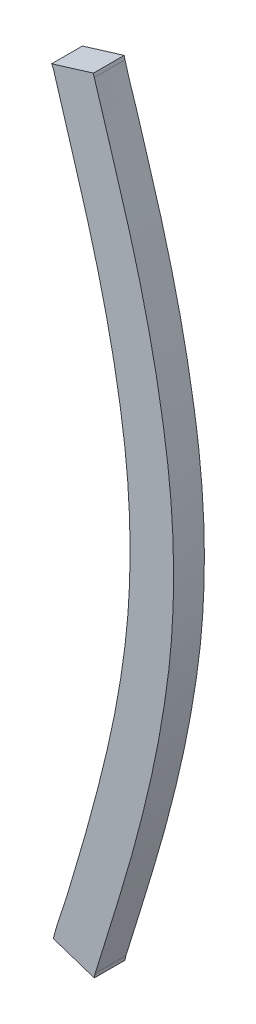
ISO-10303-21;
HEADER;
FILE_DESCRIPTION(('STEP AP214'),'2;1');
FILE_NAME('part.step','',(''),(''),'','','');
FILE_SCHEMA(('AUTOMOTIVE_DESIGN { 1 0 10303 214 1 1 1 1 }'));
ENDSEC;
DATA;
#1=APPLICATION_CONTEXT('core data for automotive mechanical design processes');
#2=APPLICATION_PROTOCOL_DEFINITION('international standard','automotive_design',2000,#1);
#3=PRODUCT_CONTEXT('',#1,'mechanical');
#4=PRODUCT('Part','Part','',(#3));
#5=PRODUCT_RELATED_PRODUCT_CATEGORY('part','',(#4));
#6=PRODUCT_DEFINITION_FORMATION('','',#4);
#7=PRODUCT_DEFINITION_CONTEXT('part definition',#1,'design');
#8=PRODUCT_DEFINITION('design','',#6,#7);
#9=PRODUCT_DEFINITION_SHAPE('','',#8);
#10=(LENGTH_UNIT() NAMED_UNIT(*) SI_UNIT(.MILLI.,.METRE.));
#11=(NAMED_UNIT(*) PLANE_ANGLE_UNIT() SI_UNIT($,.RADIAN.));
#12=(NAMED_UNIT(*) SI_UNIT($,.STERADIAN.) SOLID_ANGLE_UNIT());
#13=UNCERTAINTY_MEASURE_WITH_UNIT(LENGTH_MEASURE(1.E-05),#10,'distance_accuracy_value','');
#14=(GEOMETRIC_REPRESENTATION_CONTEXT(3) GLOBAL_UNCERTAINTY_ASSIGNED_CONTEXT((#13)) GLOBAL_UNIT_ASSIGNED_CONTEXT((#10,
#11,#12)) REPRESENTATION_CONTEXT('',''));
#15=CARTESIAN_POINT('',(0.,0.,0.));
#16=DIRECTION('',(0.,0.,1.));
#17=DIRECTION('',(1.,0.,0.));
#18=AXIS2_PLACEMENT_3D('',#15,#16,#17);
#19=CARTESIAN_POINT('',(66.3073401627196,66.6349835347944,-39.1));
#20=DIRECTION('',(0.,0.,1.));
#21=DIRECTION('',(1.,0.,0.));
#22=AXIS2_PLACEMENT_3D('',#19,#20,#21);
#23=PLANE('',#22);
#24=DIRECTION('',(-0.956199955505762,-0.292714272099566,0.));
#25=VECTOR('',#24,1.);
#26=CARTESIAN_POINT('',(66.1881037685923,67.906777776933,-39.1));
#27=LINE('',#26,#25);
#28=CARTESIAN_POINT('',(66.1881037685923,67.906777776933,-39.1));
#29=VERTEX_POINT('',#28);
#30=CARTESIAN_POINT('',(66.0521814384861,67.8651689003696,-39.1));
#31=VERTEX_POINT('',#30);
#32=EDGE_CURVE('E101',#29,#31,#27,.T.);
#33=ORIENTED_EDGE('',*,*,#32,.F.);
#34=DIRECTION('',(-0.242535624627491,0.970142500247542,0.));
#35=VECTOR('',#34,1.);
#36=CARTESIAN_POINT('',(66.1908776936903,67.8956820765211,-39.1));
#37=LINE('',#36,#35);
#38=CARTESIAN_POINT('',(66.1908776936915,67.8956820765214,-39.1));
#39=VERTEX_POINT('',#38);
#40=EDGE_CURVE('E121',#39,#29,#37,.T.);
#41=ORIENTED_EDGE('',*,*,#40,.F.);
#42=CARTESIAN_POINT('',(66.1908776936903,67.8956820765211,-39.1));
#43=CARTESIAN_POINT('',(66.1949100956217,67.879485195284,-39.1));
#44=CARTESIAN_POINT('',(66.1996702183467,67.8635135187491,-39.1));
#45=CARTESIAN_POINT('',(66.2097512732118,67.8317435159787,-39.1));
#46=CARTESIAN_POINT('',(66.2150721679429,67.8159451782574,-39.1));
#47=CARTESIAN_POINT('',(66.2253957707861,67.7841970095985,-39.1));
#48=CARTESIAN_POINT('',(66.2303975173439,67.7682468732174,-39.1));
#49=CARTESIAN_POINT('',(66.24017664113,67.7362771955672,-39.1));
#50=CARTESIAN_POINT('',(66.244954003785,67.7202576498636,-39.1));
#51=CARTESIAN_POINT('',(66.2546019658417,67.6881978226611,-39.1));
#52=CARTESIAN_POINT('',(66.2594727891244,67.6721576089782,-39.1));
#53=CARTESIAN_POINT('',(66.2692643704026,67.6400923919098,-39.1));
#54=CARTESIAN_POINT('',(66.2741851288675,67.6240673886688,-39.1));
#55=CARTESIAN_POINT('',(66.2888098463517,67.5759514918485,-39.1));
#56=CARTESIAN_POINT('',(66.2983767842087,67.5438180150709,-39.1));
#57=CARTESIAN_POINT('',(66.3167492425625,67.4793348292764,-39.1));
#58=CARTESIAN_POINT('',(66.3255548067466,67.446985132781,-39.1));
#59=CARTESIAN_POINT('',(66.3424424435593,67.3820962463252,-39.1));
#60=CARTESIAN_POINT('',(66.3505244740774,67.3495570454527,-39.1));
#61=CARTESIAN_POINT('',(66.3659243126035,67.2844568086756,-39.1));
#62=CARTESIAN_POINT('',(66.3732454935245,67.2518965750754,-39.1));
#63=CARTESIAN_POINT('',(66.3870148319496,67.1865903993272,-39.1));
#64=CARTESIAN_POINT('',(66.3934629659575,67.1538444522058,-39.1));
#65=CARTESIAN_POINT('',(66.4055119735171,67.0881885336106,-39.1));
#66=CARTESIAN_POINT('',(66.4111126137631,67.0552785195371,-39.1));
#67=CARTESIAN_POINT('',(66.4214432172407,66.9893226424474,-39.1));
#68=CARTESIAN_POINT('',(66.4261732481647,66.9562767901973,-39.1));
#69=CARTESIAN_POINT('',(66.4344361644341,66.889560300961,-39.1));
#70=CARTESIAN_POINT('',(66.4379513346324,66.8558874003231,-39.1));
#71=CARTESIAN_POINT('',(66.4434830487162,66.7884169869836,-39.1));
#72=CARTESIAN_POINT('',(66.4454994910045,66.7546194659902,-39.1));
#73=CARTESIAN_POINT('',(66.4481929946213,66.6869947243158,-39.1));
#74=CARTESIAN_POINT('',(66.448870940258,66.6531675380254,-39.1));
#75=CARTESIAN_POINT('',(66.4488341845366,66.5855149809781,-39.1));
#76=CARTESIAN_POINT('',(66.4481195653743,66.5516896102319,-39.1));
#77=CARTESIAN_POINT('',(66.4452352666491,66.4838735305297,-39.1));
#78=CARTESIAN_POINT('',(66.4430559391487,66.449883218584,-39.1));
#79=CARTESIAN_POINT('',(66.4371004000183,66.3820422554482,-39.1));
#80=CARTESIAN_POINT('',(66.4333241462651,66.3481916079659,-39.1));
#81=CARTESIAN_POINT('',(66.4244455699415,66.280653461139,-39.1));
#82=CARTESIAN_POINT('',(66.4193425831648,66.2469660521464,-39.1));
#83=CARTESIAN_POINT('',(66.4082332710518,66.1797410443805,-39.1));
#84=CARTESIAN_POINT('',(66.4022269244004,66.1462034491613,-39.1));
#85=CARTESIAN_POINT('',(66.3916574033664,66.0917353257149,-39.1));
#86=CARTESIAN_POINT('',(66.3873865759565,66.0707479796797,-39.1));
#87=CARTESIAN_POINT('',(66.3784691157759,66.0288548487377,-39.1));
#88=CARTESIAN_POINT('',(66.3738225072378,66.0079490586627,-39.1));
#89=CARTESIAN_POINT('',(66.3642111024512,65.96621830755,-39.1));
#90=CARTESIAN_POINT('',(66.3592464112983,65.9453933222014,-39.1));
#91=CARTESIAN_POINT('',(66.349044358843,65.9038097340505,-39.1));
#92=CARTESIAN_POINT('',(66.3438069885578,65.883051133459,-39.1));
#93=CARTESIAN_POINT('',(66.3330873996252,65.8415938876343,-39.1));
#94=CARTESIAN_POINT('',(66.3276051452555,65.8208952516205,-39.1));
#95=CARTESIAN_POINT('',(66.3163442664211,65.7795793046133,-39.1));
#96=CARTESIAN_POINT('',(66.31056565071,65.7589619912372,-39.1));
#97=CARTESIAN_POINT('',(66.2930007616699,65.6977009432553,-39.1));
#98=CARTESIAN_POINT('',(66.2808579810464,65.6571601672551,-39.1));
#99=CARTESIAN_POINT('',(66.2624215985308,65.5964211329038,-39.1));
#100=CARTESIAN_POINT('',(66.25623944103,65.5761878964162,-39.1));
#101=CARTESIAN_POINT('',(66.2438478011464,65.5357299214944,-39.1));
#102=CARTESIAN_POINT('',(66.237638319145,65.5155051829458,-39.1));
#103=CARTESIAN_POINT('',(66.2251718914417,65.4750856272525,-39.1));
#104=CARTESIAN_POINT('',(66.2189149814144,65.4548907990922,-39.1));
#105=CARTESIAN_POINT('',(66.2063357490695,65.414521237999,-39.1));
#106=CARTESIAN_POINT('',(66.2000134258803,65.394346505338,-39.1));
#107=CARTESIAN_POINT('',(66.1936516187903,65.3741841569611,-39.1));
#108=B_SPLINE_CURVE_WITH_KNOTS('',3,(#42,#43,#44,#45,#46,#47,#48,#49,#50,#51,#52,#53,#54,#55,
#56,#57,#58,#59,#60,#61,#62,#63,#64,#65,#66,#67,#68,#69,#70,#71,#72,#73,#74,#75,#76,#77,#78,#79,
#80,#81,#82,#83,#84,#85,#86,#87,#88,#89,#90,#91,#92,#93,#94,#95,#96,#97,#98,#99,#100,#101,#102,
#103,#104,#105,#106,#107),.UNSPECIFIED.,.F.,.F.,(4,2,2,2,2,2,2,2,2,2,2,2,2,2,2,2,2,2,2,2,2,2,2,
2,2,2,2,2,2,2,2,2,4),(0.,0.050005533873164,0.100007733990341,0.150154089960554,
0.200303698352787,0.250593931280111,0.300884637337104,0.401460712453303,0.502031012749006,
0.602607162584607,0.702716504353397,0.802828539807175,0.902968085035616,1.00309984082596,
1.1046355514676,1.20617814448562,1.30765362860986,1.40912312334895,1.51126762805103,
1.61341482726061,1.71561326353314,1.81781411160631,1.8820630523216,1.94630785315916,
2.01053153562376,2.07475733509857,2.13899253428385,2.20322583723369,2.33018001954719,
2.39365028116976,2.45711965961665,2.52054528003948,2.58397174672142),.UNSPECIFIED.);
#109=CARTESIAN_POINT('',(66.1936516187903,65.3741841569611,-39.1));
#110=VERTEX_POINT('',#109);
#111=EDGE_CURVE('E188',#39,#110,#108,.T.);
#112=ORIENTED_EDGE('',*,*,#111,.T.);
#113=DIRECTION('',(-0.196116135135519,-0.980580675691453,0.));
#114=VECTOR('',#113,1.);
#115=CARTESIAN_POINT('',(66.1908776936865,65.3603145314419,-39.1));
#116=LINE('',#115,#114);
#117=CARTESIAN_POINT('',(66.1908776936866,65.3603145314423,-39.1));
#118=VERTEX_POINT('',#117);
#119=EDGE_CURVE('E125',#110,#118,#116,.T.);
#120=ORIENTED_EDGE('',*,*,#119,.T.);
#121=DIRECTION('',(-0.948683298050562,0.316227766016693,0.));
#122=VECTOR('',#121,1.);
#123=CARTESIAN_POINT('',(66.0577292886893,65.4046973331081,-39.1));
#124=LINE('',#123,#122);
#125=CARTESIAN_POINT('',(66.0577292886896,65.4046973331091,-39.1));
#126=VERTEX_POINT('',#125);
#127=EDGE_CURVE('E132',#118,#126,#124,.T.);
#128=ORIENTED_EDGE('',*,*,#127,.T.);
#129=DIRECTION('',(0.242535625038474,0.970142500144797,0.));
#130=VECTOR('',#129,1.);
#131=CARTESIAN_POINT('',(66.0605032137927,65.4157930335206,-39.1));
#132=LINE('',#131,#130);
#133=CARTESIAN_POINT('',(66.0605032137915,65.4157930335208,-39.1));
#134=VERTEX_POINT('',#133);
#135=EDGE_CURVE('E104',#126,#134,#132,.T.);
#136=ORIENTED_EDGE('',*,*,#135,.T.);
#137=CARTESIAN_POINT('',(66.0605032137903,65.4157930335211,-39.1));
#138=CARTESIAN_POINT('',(66.0645436760544,65.431991659247,-39.1));
#139=CARTESIAN_POINT('',(66.0694367751525,65.4479186572461,-39.1));
#140=CARTESIAN_POINT('',(66.0798208785655,65.4795843167803,-39.1));
#141=CARTESIAN_POINT('',(66.0853118849576,65.4953229776608,-39.1));
#142=CARTESIAN_POINT('',(66.0958031573863,65.5270234788328,-39.1));
#143=CARTESIAN_POINT('',(66.1008015941166,65.542985916827,-39.1));
#144=CARTESIAN_POINT('',(66.1105078497719,65.5749970870055,-39.1));
#145=CARTESIAN_POINT('',(66.1152156689648,65.5910458191102,-39.1));
#146=CARTESIAN_POINT('',(66.1294512207146,65.6392539812142,-39.1));
#147=CARTESIAN_POINT('',(66.1390658524147,65.6713877429036,-39.1));
#148=CARTESIAN_POINT('',(66.1578111251696,65.7357939340475,-39.1));
#149=CARTESIAN_POINT('',(66.166941816939,65.7680663485871,-39.1));
#150=CARTESIAN_POINT('',(66.1846694851496,65.8327615228004,-39.1));
#151=CARTESIAN_POINT('',(66.1932663898901,65.865184302046,-39.1));
#152=CARTESIAN_POINT('',(66.2100327991604,65.9301537387485,-39.1));
#153=CARTESIAN_POINT('',(66.2182021336407,65.9627004400527,-39.1));
#154=CARTESIAN_POINT('',(66.2338174308743,66.0277860622279,-39.1));
#155=CARTESIAN_POINT('',(66.2412670359188,66.0603240898983,-39.1));
#156=CARTESIAN_POINT('',(66.2550831613337,66.1256334854618,-39.1));
#157=CARTESIAN_POINT('',(66.2614495916585,66.1584048725187,-39.1));
#158=CARTESIAN_POINT('',(66.2731884317776,66.2241004199131,-39.1));
#159=CARTESIAN_POINT('',(66.2785615498504,66.2570244541002,-39.1));
#160=CARTESIAN_POINT('',(66.2881078088414,66.3230448940766,-39.1));
#161=CARTESIAN_POINT('',(66.2922811512317,66.3561412699739,-39.1));
#162=CARTESIAN_POINT('',(66.2991584679311,66.4229712234038,-39.1));
#163=CARTESIAN_POINT('',(66.3018403787454,66.4567071059616,-39.1));
#164=CARTESIAN_POINT('',(66.3056611295301,66.5242711142321,-39.1));
#165=CARTESIAN_POINT('',(66.3067996744955,66.5580992563417,-39.1));
#166=CARTESIAN_POINT('',(66.3076173534394,66.6257808704905,-39.1));
#167=CARTESIAN_POINT('',(66.3072960907074,66.6596343469152,-39.1));
#168=CARTESIAN_POINT('',(66.3052637466596,66.7272945844777,-39.1));
#169=CARTESIAN_POINT('',(66.3035528984555,66.7611013524984,-39.1));
#170=CARTESIAN_POINT('',(66.2985822901862,66.8288648138037,-39.1));
#171=CARTESIAN_POINT('',(66.2953106882462,66.862820653042,-39.1));
#172=CARTESIAN_POINT('',(66.287332990706,66.930561862238,-39.1));
#173=CARTESIAN_POINT('',(66.2826266753372,66.9643472052725,-39.1));
#174=CARTESIAN_POINT('',(66.2670161695563,67.0654664361305,-39.1));
#175=CARTESIAN_POINT('',(66.2546192533633,67.1325758688591,-39.1));
#176=CARTESIAN_POINT('',(66.2343301742017,67.2271624953206,-39.1));
#177=CARTESIAN_POINT('',(66.2280116422179,67.2549885582841,-39.1));
#178=CARTESIAN_POINT('',(66.2148371136719,67.3105129732235,-39.1));
#179=CARTESIAN_POINT('',(66.2079811242059,67.3382113268804,-39.1));
#180=CARTESIAN_POINT('',(66.1937787023789,67.3934827757198,-39.1));
#181=CARTESIAN_POINT('',(66.186432261494,67.4210558687165,-39.1));
#182=CARTESIAN_POINT('',(66.1711713276532,67.4760443448068,-39.1));
#183=CARTESIAN_POINT('',(66.1632568269273,67.5034597257378,-39.1));
#184=CARTESIAN_POINT('',(66.147235416187,67.5578243956035,-39.1));
#185=CARTESIAN_POINT('',(66.1391326331913,67.5847749205434,-39.1));
#186=CARTESIAN_POINT('',(66.1228816786696,67.6386622693352,-39.1));
#187=CARTESIAN_POINT('',(66.1147335071075,67.6655990931764,-39.1));
#188=CARTESIAN_POINT('',(66.0984680670764,67.7194666338239,-39.1));
#189=CARTESIAN_POINT('',(66.0903507846181,67.7463973464012,-39.1));
#190=CARTESIAN_POINT('',(66.07408147356,67.8002479584269,-39.1));
#191=CARTESIAN_POINT('',(66.0659294453172,67.8271678579833,-39.1));
#192=CARTESIAN_POINT('',(66.0577292886903,67.8540731999611,-39.1));
#193=B_SPLINE_CURVE_WITH_KNOTS('',3,(#137,#138,#139,#140,#141,#142,#143,#144,#145,#146,#147,
#148,#149,#150,#151,#152,#153,#154,#155,#156,#157,#158,#159,#160,#161,#162,#163,#164,#165,#166,
#167,#168,#169,#170,#171,#172,#173,#174,#175,#176,#177,#178,#179,#180,#181,#182,#183,#184,#185,
#186,#187,#188,#189,#190,#191,#192),.UNSPECIFIED.,.F.,.F.,(4,2,2,2,2,2,2,2,2,2,2,2,2,2,2,2,2,2,
2,2,2,2,2,2,2,2,2,4),(0.,0.0499954329236569,0.0999910395343713,0.150165826672778,
0.200340567537613,0.300963593300606,0.401576053292174,0.50220199891074,0.602867665154967,
0.702993807681116,0.803128269754976,0.903191053492104,1.00323702437346,1.10472612494109,
1.20623462180185,1.30777070578083,1.40928975996393,1.51159162368106,1.61390916581287,
1.81850711613617,1.9041061024088,1.9897039586985,2.07530330305843,2.16090381847206,
2.24533044861808,2.32975714595277,2.41413947779715,2.49852094467752),.UNSPECIFIED.);
#194=CARTESIAN_POINT('',(66.0577292886903,67.8540731999611,-39.1));
#195=VERTEX_POINT('',#194);
#196=EDGE_CURVE('E24',#134,#195,#193,.T.);
#197=ORIENTED_EDGE('',*,*,#196,.T.);
#198=DIRECTION('',(-0.447213595498112,0.894427191000839,0.));
#199=VECTOR('',#198,1.);
#200=CARTESIAN_POINT('',(66.0521814384863,67.8651689003691,-39.1));
#201=LINE('',#200,#199);
#202=EDGE_CURVE('E92',#195,#31,#201,.T.);
#203=ORIENTED_EDGE('',*,*,#202,.T.);
#204=EDGE_LOOP('',(#33,#41,#112,#120,#128,#136,#197,#203));
#205=FACE_BOUND('',#204,.T.);
#206=ADVANCED_FACE('F17',(#205),#23,.F.);
#207=CARTESIAN_POINT('',(66.0521814384863,67.8651689003691,-39.));
#208=DIRECTION('',(0.894427191000839,0.447213595498112,0.));
#209=DIRECTION('',(-0.447213595498112,0.894427191000839,0.));
#210=AXIS2_PLACEMENT_3D('',#207,#208,#209);
#211=PLANE('',#210);
#212=DIRECTION('',(0.,0.,1.));
#213=VECTOR('',#212,1.);
#214=CARTESIAN_POINT('',(66.0577292886903,67.8540731999611,-39.05));
#215=LINE('',#214,#213);
#216=CARTESIAN_POINT('',(66.0577292886903,67.8540731999611,-39.));
#217=VERTEX_POINT('',#216);
#218=EDGE_CURVE('E95',#195,#217,#215,.T.);
#219=ORIENTED_EDGE('',*,*,#218,.T.);
#220=DIRECTION('',(0.447213595498616,-0.894427191000587,0.));
#221=VECTOR('',#220,1.);
#222=CARTESIAN_POINT('',(66.0521814384863,67.8651689003691,-39.));
#223=LINE('',#222,#221);
#224=CARTESIAN_POINT('',(66.0521814384862,67.8651689003694,-39.));
#225=VERTEX_POINT('',#224);
#226=EDGE_CURVE('E116',#225,#217,#223,.T.);
#227=ORIENTED_EDGE('',*,*,#226,.F.);
#228=DIRECTION('',(0.,0.,1.));
#229=VECTOR('',#228,1.);
#230=CARTESIAN_POINT('',(66.0521814384861,67.8651689003699,-39.));
#231=LINE('',#230,#229);
#232=EDGE_CURVE('E98',#225,#31,#231,.F.);
#233=ORIENTED_EDGE('',*,*,#232,.T.);
#234=ORIENTED_EDGE('',*,*,#202,.F.);
#235=EDGE_LOOP('',(#219,#227,#233,#234));
#236=FACE_BOUND('',#235,.T.);
#237=ADVANCED_FACE('F93',(#236),#211,.F.);
#238=CARTESIAN_POINT('',(66.0577292886903,67.8540731999611,-39.));
#239=CARTESIAN_POINT('',(66.0577292886903,67.8540731999611,-39.1));
#240=CARTESIAN_POINT('',(66.0682059216903,67.8196707865311,-39.));
#241=CARTESIAN_POINT('',(66.0682059216903,67.8196707865311,-39.1));
#242=CARTESIAN_POINT('',(66.0889660642903,67.7510438935911,-39.));
#243=CARTESIAN_POINT('',(66.0889660642903,67.7510438935911,-39.1));
#244=CARTESIAN_POINT('',(66.1198972626903,67.6483951213011,-39.));
#245=CARTESIAN_POINT('',(66.1198972626903,67.6483951213011,-39.1));
#246=CARTESIAN_POINT('',(66.1507857816903,67.5464464069211,-39.));
#247=CARTESIAN_POINT('',(66.1507857816903,67.5464464069211,-39.1));
#248=CARTESIAN_POINT('',(66.1803116247903,67.4447880284311,-39.));
#249=CARTESIAN_POINT('',(66.1803116247903,67.4447880284311,-39.1));
#250=CARTESIAN_POINT('',(66.2070617543903,67.3430309216311,-39.));
#251=CARTESIAN_POINT('',(66.2070617543903,67.3430309216311,-39.1));
#252=CARTESIAN_POINT('',(66.2315118897903,67.2412876562511,-39.));
#253=CARTESIAN_POINT('',(66.2315118897903,67.2412876562511,-39.1));
#254=CARTESIAN_POINT('',(66.2531842173903,67.1393699167511,-39.));
#255=CARTESIAN_POINT('',(66.2531842173903,67.1393699167511,-39.1));
#256=CARTESIAN_POINT('',(66.2716239185903,67.0371418328911,-39.));
#257=CARTESIAN_POINT('',(66.2716239185903,67.0371418328911,-39.1));
#258=CARTESIAN_POINT('',(66.2872518356903,66.9344695807911,-39.));
#259=CARTESIAN_POINT('',(66.2872518356903,66.9344695807911,-39.1));
#260=CARTESIAN_POINT('',(66.2989974867903,66.8308116247711,-39.));
#261=CARTESIAN_POINT('',(66.2989974867903,66.8308116247711,-39.1));
#262=CARTESIAN_POINT('',(66.3058533485903,66.7257514799511,-39.));
#263=CARTESIAN_POINT('',(66.3058533485903,66.7257514799511,-39.1));
#264=CARTESIAN_POINT('',(66.3081504652903,66.6208066220911,-39.));
#265=CARTESIAN_POINT('',(66.3081504652903,66.6208066220911,-39.1));
#266=CARTESIAN_POINT('',(66.3058569310903,66.5167834233211,-39.));
#267=CARTESIAN_POINT('',(66.3058569310903,66.5167834233211,-39.1));
#268=CARTESIAN_POINT('',(66.2989583077903,66.4144984925611,-39.));
#269=CARTESIAN_POINT('',(66.2989583077903,66.4144984925611,-39.1));
#270=CARTESIAN_POINT('',(66.2872464836903,66.3130391608211,-39.));
#271=CARTESIAN_POINT('',(66.2872464836903,66.3130391608211,-39.1));
#272=CARTESIAN_POINT('',(66.2714906956903,66.2120963559811,-39.));
#273=CARTESIAN_POINT('',(66.2714906956903,66.2120963559811,-39.1));
#274=CARTESIAN_POINT('',(66.2525990837903,66.1112429406511,-39.));
#275=CARTESIAN_POINT('',(66.2525990837903,66.1112429406511,-39.1));
#276=CARTESIAN_POINT('',(66.2300881828903,66.0106192574711,-39.));
#277=CARTESIAN_POINT('',(66.2300881828903,66.0106192574711,-39.1));
#278=CARTESIAN_POINT('',(66.2051511905903,65.9103324506311,-39.));
#279=CARTESIAN_POINT('',(66.2051511905903,65.9103324506311,-39.1));
#280=CARTESIAN_POINT('',(66.1788355862903,65.8104486998011,-39.));
#281=CARTESIAN_POINT('',(66.1788355862903,65.8104486998011,-39.1));
#282=CARTESIAN_POINT('',(66.1509451438903,65.7111680410211,-39.));
#283=CARTESIAN_POINT('',(66.1509451438903,65.7111680410211,-39.1));
#284=CARTESIAN_POINT('',(66.1214054898903,65.6124769099411,-39.));
#285=CARTESIAN_POINT('',(66.1214054898903,65.6124769099411,-39.1));
#286=CARTESIAN_POINT('',(66.0926415411903,65.5136308285811,-39.));
#287=CARTESIAN_POINT('',(66.0926415411903,65.5136308285811,-39.1));
#288=CARTESIAN_POINT('',(66.0688251942903,65.4490809554711,-39.));
#289=CARTESIAN_POINT('',(66.0688251942903,65.4490809554711,-39.1));
#290=CARTESIAN_POINT('',(66.0605032137903,65.4157930335211,-39.));
#291=CARTESIAN_POINT('',(66.0605032137903,65.4157930335211,-39.1));
#292=B_SPLINE_SURFACE_WITH_KNOTS('',3,1,((#238,#239),(#240,#241),(#242,#243),(#244,#245),(#246,
#247),(#248,#249),(#250,#251),(#252,#253),(#254,#255),(#256,#257),(#258,#259),(#260,#261),(#262,
#263),(#264,#265),(#266,#267),(#268,#269),(#270,#271),(#272,#273),(#274,#275),(#276,#277),(#278,
#279),(#280,#281),(#282,#283),(#284,#285),(#286,#287),(#288,#289),(#290,#291)),.UNSPECIFIED.,
.F.,.F.,.F.,(4,1,1,1,1,1,1,1,1,1,1,1,1,1,1,1,1,1,1,1,1,1,1,1,4),(2,2),(0.,0.043180384185,
0.0860889057703,0.1287256158318,0.1710872886221,0.213186632967,0.2550452771582,0.2967197910893,
0.338277659337,0.3797556249214,0.4214002315702,0.4634955092493,0.5061260175783,0.5473999091414,
0.5883874389168,0.6291739907487,0.6699905193445,0.7110360652346,0.7523539460835,0.7937768432598,
0.8351133190984,0.876373889477,0.91759317835728,0.95880065173907,1.),(1.,1.1),.UNSPECIFIED.);
#293=DIRECTION('',(0.,0.,1.));
#294=VECTOR('',#293,1.);
#295=CARTESIAN_POINT('',(66.0605032137927,65.4157930335205,-39.));
#296=LINE('',#295,#294);
#297=CARTESIAN_POINT('',(66.0605032137915,65.4157930335208,-39.));
#298=VERTEX_POINT('',#297);
#299=EDGE_CURVE('E106',#134,#298,#296,.T.);
#300=CARTESIAN_POINT('',(66.0577292886903,67.8540731999611,-39.));
#301=CARTESIAN_POINT('',(66.0625765045228,67.8381568203957,-39.));
#302=CARTESIAN_POINT('',(66.0674098330503,67.8222362224864,-39.));
#303=CARTESIAN_POINT('',(66.0770578450639,67.790390388363,-39.));
#304=CARTESIAN_POINT('',(66.0818725296193,67.7744651524731,-39.));
#305=CARTESIAN_POINT('',(66.0915097617172,67.7425563082784,-39.));
#306=CARTESIAN_POINT('',(66.0963322779056,67.7265726905381,-39.));
#307=CARTESIAN_POINT('',(66.105975280674,67.6946037892601,-39.));
#308=CARTESIAN_POINT('',(66.1107957671178,67.6786185056798,-39.));
#309=CARTESIAN_POINT('',(66.1253282847959,67.6305122578105,-39.));
#310=CARTESIAN_POINT('',(66.1350640691024,67.5983986066873,-39.));
#311=CARTESIAN_POINT('',(66.1542868300022,67.5340963305532,-39.));
#312=CARTESIAN_POINT('',(66.163773815108,67.5019077081486,-39.));
#313=CARTESIAN_POINT('',(66.1820179296096,67.4373241178828,-39.));
#314=CARTESIAN_POINT('',(66.1907750908158,67.4049291590814,-39.));
#315=CARTESIAN_POINT('',(66.2075870821379,67.3399568279704,-39.));
#316=CARTESIAN_POINT('',(66.2156418823061,67.3073794479456,-39.));
#317=CARTESIAN_POINT('',(66.2309634832392,67.2422259613772,-39.));
#318=CARTESIAN_POINT('',(66.2382343473944,67.209650819591,-39.));
#319=CARTESIAN_POINT('',(66.2518175929954,67.1443019854111,-39.));
#320=CARTESIAN_POINT('',(66.2581300141567,67.1115283013032,-39.));
#321=CARTESIAN_POINT('',(66.2698602898268,67.0458192693772,-39.));
#322=CARTESIAN_POINT('',(66.2752780753739,67.0128839092981,-39.));
#323=CARTESIAN_POINT('',(66.2850913178377,66.9468498666373,-39.));
#324=CARTESIAN_POINT('',(66.2894865362087,66.9137511477824,-39.));
#325=CARTESIAN_POINT('',(66.2969030720198,66.8469154614683,-39.));
#326=CARTESIAN_POINT('',(66.2999038145204,66.8131761414646,-39.));
#327=CARTESIAN_POINT('',(66.3044024224437,66.745596607334,-39.));
#328=CARTESIAN_POINT('',(66.3058999862107,66.7117563743221,-39.));
#329=CARTESIAN_POINT('',(66.3083014751542,66.6101989961185,-39.));
#330=CARTESIAN_POINT('',(66.3071179812932,66.5424095576034,-39.));
#331=CARTESIAN_POINT('',(66.3006425401016,66.4407854931689,-39.));
#332=CARTESIAN_POINT('',(66.2976799155136,66.4067889076926,-39.));
#333=CARTESIAN_POINT('',(66.2902006665804,66.3389722671435,-39.));
#334=CARTESIAN_POINT('',(66.2856842430529,66.3051521898313,-39.));
#335=CARTESIAN_POINT('',(66.2754634513363,66.2376736372593,-39.));
#336=CARTESIAN_POINT('',(66.2697583056408,66.2040152825921,-39.));
#337=CARTESIAN_POINT('',(66.2604322664806,66.1536710494427,-39.));
#338=CARTESIAN_POINT('',(66.2571954799501,66.136913275576,-39.));
#339=CARTESIAN_POINT('',(66.2504267239271,66.1034574810634,-39.));
#340=CARTESIAN_POINT('',(66.246894757712,66.0867594597562,-39.));
#341=CARTESIAN_POINT('',(66.2371278836179,66.0422430448912,-39.));
#342=CARTESIAN_POINT('',(66.2306682956901,66.0144741303286,-39.));
#343=CARTESIAN_POINT('',(66.217266904339,65.9590540606052,-39.));
#344=CARTESIAN_POINT('',(66.2103250926801,65.9314029074639,-39.));
#345=CARTESIAN_POINT('',(66.1961292788674,65.8761890095506,-39.));
#346=CARTESIAN_POINT('',(66.1888753621807,65.8486262427684,-39.));
#347=CARTESIAN_POINT('',(66.1740017612852,65.793599841515,-39.));
#348=CARTESIAN_POINT('',(66.1663820854572,65.7661362047878,-39.));
#349=CARTESIAN_POINT('',(66.154710692457,65.7252031064748,-39.));
#350=CARTESIAN_POINT('',(66.150806634809,65.7116913842068,-39.));
#351=CARTESIAN_POINT('',(66.1429183228255,65.6846910088886,-39.));
#352=CARTESIAN_POINT('',(66.1389340661802,65.671202356515,-39.));
#353=CARTESIAN_POINT('',(66.1309437058614,65.6442311967391,-39.));
#354=CARTESIAN_POINT('',(66.1269376016802,65.6307486894875,-39.));
#355=CARTESIAN_POINT('',(66.1189723051318,65.6037707192732,-39.));
#356=CARTESIAN_POINT('',(66.1150131100971,65.5902752570948,-39.));
#357=CARTESIAN_POINT('',(66.1069853916346,65.5633188692329,-39.));
#358=CARTESIAN_POINT('',(66.1029168873732,65.5498579379423,-39.));
#359=CARTESIAN_POINT('',(66.096598929694,65.5297330350213,-39.));
#360=CARTESIAN_POINT('',(66.0944570239403,65.5230356594335,-39.));
#361=CARTESIAN_POINT('',(66.0900747169011,65.5096731078983,-39.));
#362=CARTESIAN_POINT('',(66.0878343083195,65.5030079343769,-39.));
#363=CARTESIAN_POINT('',(66.0810725134284,65.4830236805948,-39.));
#364=CARTESIAN_POINT('',(66.076510786799,65.4697165615948,-39.));
#365=CARTESIAN_POINT('',(66.0679337706379,65.4429326386184,-39.));
#366=CARTESIAN_POINT('',(66.0639184652815,65.4294558395685,-39.));
#367=CARTESIAN_POINT('',(66.0605032137903,65.4157930335211,-39.));
#368=B_SPLINE_CURVE_WITH_KNOTS('',3,(#300,#301,#302,#303,#304,#305,#306,#307,#308,#309,#310,
#311,#312,#313,#314,#315,#316,#317,#318,#319,#320,#321,#322,#323,#324,#325,#326,#327,#328,#329,
#330,#331,#332,#333,#334,#335,#336,#337,#338,#339,#340,#341,#342,#343,#344,#345,#346,#347,#348,
#349,#350,#351,#352,#353,#354,#355,#356,#357,#358,#359,#360,#361,#362,#363,#364,#365,#366,#367),
.UNSPECIFIED.,.F.,.F.,(4,2,2,2,2,2,2,2,2,2,2,2,2,2,2,2,2,2,2,2,2,2,2,2,2,2,2,2,2,2,2,2,2,4),(0.,
0.0499143052477696,0.0998257038452558,0.149911588865139,0.20000042508618,0.300672048602656,
0.40134022321576,0.502004007753483,0.602672082323304,0.702790359615609,0.802904487116077,
0.903026328169082,1.00317150241112,1.10475071443923,1.2063503071685,1.4094423379735,
1.51178644290729,1.61411732554797,1.71651535094635,1.76771587309228,1.81891582684958,
1.90443969333295,1.98996502078658,2.07546707515571,2.16096717129612,2.20316019573632,
2.24535443702104,2.28754966304151,2.32974247789627,2.37192794227109,2.3930216680582,
2.41411695890005,2.45630973467194,2.49850128825252),.UNSPECIFIED.);
#369=EDGE_CURVE('E109',#217,#298,#368,.T.);
#370=ORIENTED_EDGE('',*,*,#299,.T.);
#371=ORIENTED_EDGE('',*,*,#369,.F.);
#372=ORIENTED_EDGE('',*,*,#218,.F.);
#373=ORIENTED_EDGE('',*,*,#196,.F.);
#374=EDGE_LOOP('',(#370,#371,#372,#373));
#375=FACE_BOUND('',#374,.T.);
#376=ADVANCED_FACE('F107',(#375),#292,.F.);
#377=CARTESIAN_POINT('',(66.0605032137927,65.4157930335206,-39.));
#378=DIRECTION('',(0.970142500144797,-0.242535625038474,0.));
#379=DIRECTION('',(0.242535625038474,0.970142500144797,0.));
#380=AXIS2_PLACEMENT_3D('',#377,#378,#379);
#381=PLANE('',#380);
#382=DIRECTION('',(0.,0.,1.));
#383=VECTOR('',#382,1.);
#384=CARTESIAN_POINT('',(66.0577292886893,65.4046973331081,-39.));
#385=LINE('',#384,#383);
#386=CARTESIAN_POINT('',(66.05772928869,65.4046973331101,-39.));
#387=VERTEX_POINT('',#386);
#388=EDGE_CURVE('E134',#126,#387,#385,.T.);
#389=ORIENTED_EDGE('',*,*,#388,.T.);
#390=DIRECTION('',(-0.242535624830199,-0.970142500196865,0.));
#391=VECTOR('',#390,1.);
#392=CARTESIAN_POINT('',(66.0605032137903,65.4157930335211,-39.));
#393=LINE('',#392,#391);
#394=EDGE_CURVE('E211',#298,#387,#393,.T.);
#395=ORIENTED_EDGE('',*,*,#394,.F.);
#396=ORIENTED_EDGE('',*,*,#299,.F.);
#397=ORIENTED_EDGE('',*,*,#135,.F.);
#398=EDGE_LOOP('',(#389,#395,#396,#397));
#399=FACE_BOUND('',#398,.T.);
#400=ADVANCED_FACE('F176',(#399),#381,.F.);
#401=CARTESIAN_POINT('',(66.0577292886893,65.4046973331081,-39.));
#402=DIRECTION('',(0.316227766016693,0.948683298050562,0.));
#403=DIRECTION('',(-0.948683298050562,0.316227766016693,0.));
#404=AXIS2_PLACEMENT_3D('',#401,#402,#403);
#405=PLANE('',#404);
#406=DIRECTION('',(0.,0.,1.));
#407=VECTOR('',#406,1.);
#408=CARTESIAN_POINT('',(66.1908776936866,65.3603145314423,-39.));
#409=LINE('',#408,#407);
#410=CARTESIAN_POINT('',(66.1908776936866,65.3603145314423,-39.));
#411=VERTEX_POINT('',#410);
#412=EDGE_CURVE('E129',#118,#411,#409,.T.);
#413=ORIENTED_EDGE('',*,*,#412,.T.);
#414=DIRECTION('',(0.948683298043296,-0.316227766038493,0.));
#415=VECTOR('',#414,1.);
#416=CARTESIAN_POINT('',(66.0577292886903,65.4046973331111,-39.));
#417=LINE('',#416,#415);
#418=EDGE_CURVE('E208',#387,#411,#417,.T.);
#419=ORIENTED_EDGE('',*,*,#418,.F.);
#420=ORIENTED_EDGE('',*,*,#388,.F.);
#421=ORIENTED_EDGE('',*,*,#127,.F.);
#422=EDGE_LOOP('',(#413,#419,#420,#421));
#423=FACE_BOUND('',#422,.T.);
#424=ADVANCED_FACE('F172',(#423),#405,.F.);
#425=CARTESIAN_POINT('',(66.1908776936865,65.3603145314419,-39.));
#426=DIRECTION('',(-0.980580675691453,0.196116135135519,0.));
#427=DIRECTION('',(-0.196116135135519,-0.980580675691453,0.));
#428=AXIS2_PLACEMENT_3D('',#425,#426,#427);
#429=PLANE('',#428);
#430=DIRECTION('',(0.,0.,1.));
#431=VECTOR('',#430,1.);
#432=CARTESIAN_POINT('',(66.1936516187903,65.3741841569611,-39.05));
#433=LINE('',#432,#431);
#434=CARTESIAN_POINT('',(66.1936516187903,65.3741841569611,-39.));
#435=VERTEX_POINT('',#434);
#436=EDGE_CURVE('E128',#110,#435,#433,.T.);
#437=ORIENTED_EDGE('',*,*,#436,.T.);
#438=DIRECTION('',(0.196116135134976,0.980580675691562,0.));
#439=VECTOR('',#438,1.);
#440=CARTESIAN_POINT('',(66.1908776936866,65.3603145314423,-39.));
#441=LINE('',#440,#439);
#442=EDGE_CURVE('E151',#411,#435,#441,.T.);
#443=ORIENTED_EDGE('',*,*,#442,.F.);
#444=ORIENTED_EDGE('',*,*,#412,.F.);
#445=ORIENTED_EDGE('',*,*,#119,.F.);
#446=EDGE_LOOP('',(#437,#443,#444,#445));
#447=FACE_BOUND('',#446,.T.);
#448=ADVANCED_FACE('F169',(#447),#429,.F.);
#449=CARTESIAN_POINT('',(66.1936516187903,65.3741841569611,-39.));
#450=CARTESIAN_POINT('',(66.1936516187903,65.3741841569611,-39.1));
#451=CARTESIAN_POINT('',(66.2041784498903,65.4075432174612,-39.));
#452=CARTESIAN_POINT('',(66.2041784498903,65.4075432174612,-39.1));
#453=CARTESIAN_POINT('',(66.2250603300903,65.4744885922411,-39.));
#454=CARTESIAN_POINT('',(66.2250603300903,65.4744885922411,-39.1));
#455=CARTESIAN_POINT('',(66.2560005596903,65.5752864088011,-39.));
#456=CARTESIAN_POINT('',(66.2560005596903,65.5752864088011,-39.1));
#457=CARTESIAN_POINT('',(66.2868153495903,65.6765543430611,-39.));
#458=CARTESIAN_POINT('',(66.2868153495903,65.6765543430611,-39.1));
#459=CARTESIAN_POINT('',(66.3164177091903,65.7784541541111,-39.));
#460=CARTESIAN_POINT('',(66.3164177091903,65.7784541541111,-39.1));
#461=CARTESIAN_POINT('',(66.3436282727903,65.8811324841211,-39.));
#462=CARTESIAN_POINT('',(66.3436282727903,65.8811324841211,-39.1));
#463=CARTESIAN_POINT('',(66.3688462076903,65.9843498775512,-39.));
#464=CARTESIAN_POINT('',(66.3688462076903,65.9843498775512,-39.1));
#465=CARTESIAN_POINT('',(66.3914524266903,66.0882053069711,-39.));
#466=CARTESIAN_POINT('',(66.3914524266903,66.0882053069711,-39.1));
#467=CARTESIAN_POINT('',(66.4107999248903,66.1927490688611,-39.));
#468=CARTESIAN_POINT('',(66.4107999248903,66.1927490688611,-39.1));
#469=CARTESIAN_POINT('',(66.4273583407903,66.2979286080511,-39.));
#470=CARTESIAN_POINT('',(66.4273583407903,66.2979286080511,-39.1));
#471=CARTESIAN_POINT('',(66.4398895685903,66.4041010798911,-39.));
#472=CARTESIAN_POINT('',(66.4398895685903,66.4041010798911,-39.1));
#473=CARTESIAN_POINT('',(66.4472276760903,66.5114840789011,-39.));
#474=CARTESIAN_POINT('',(66.4472276760903,66.5114840789011,-39.1));
#475=CARTESIAN_POINT('',(66.4496722124903,66.6208579481711,-39.));
#476=CARTESIAN_POINT('',(66.4496722124903,66.6208579481711,-39.1));
#477=CARTESIAN_POINT('',(66.4472189636903,66.7313073394211,-39.));
#478=CARTESIAN_POINT('',(66.4472189636903,66.7313073394211,-39.1));
#479=CARTESIAN_POINT('',(66.4399079052903,66.8419246016811,-39.));
#480=CARTESIAN_POINT('',(66.4399079052903,66.8419246016811,-39.1));
#481=CARTESIAN_POINT('',(66.4273683415903,66.9510759169511,-39.));
#482=CARTESIAN_POINT('',(66.4273683415903,66.9510759169511,-39.1));
#483=CARTESIAN_POINT('',(66.4108022834903,67.0590805242611,-39.));
#484=CARTESIAN_POINT('',(66.4108022834903,67.0590805242611,-39.1));
#485=CARTESIAN_POINT('',(66.3914461729903,67.1663947214511,-39.));
#486=CARTESIAN_POINT('',(66.3914461729903,67.1663947214511,-39.1));
#487=CARTESIAN_POINT('',(66.3688855687903,67.2729954539511,-39.));
#488=CARTESIAN_POINT('',(66.3688855687903,67.2729954539511,-39.1));
#489=CARTESIAN_POINT('',(66.3435622828903,67.3788127222111,-39.));
#490=CARTESIAN_POINT('',(66.3435622828903,67.3788127222111,-39.1));
#491=CARTESIAN_POINT('',(66.3158764171903,67.4838080767411,-39.));
#492=CARTESIAN_POINT('',(66.3158764171903,67.4838080767411,-39.1));
#493=CARTESIAN_POINT('',(66.2855150246903,67.5877391415711,-39.));
#494=CARTESIAN_POINT('',(66.2855150246903,67.5877391415711,-39.1));
#495=CARTESIAN_POINT('',(66.2535508017903,67.6907667646811,-39.));
#496=CARTESIAN_POINT('',(66.2535508017903,67.6907667646811,-39.1));
#497=CARTESIAN_POINT('',(66.2232930412903,67.7937336746311,-39.));
#498=CARTESIAN_POINT('',(66.2232930412903,67.7937336746311,-39.1));
#499=CARTESIAN_POINT('',(66.1995081505903,67.8611602491412,-39.));
#500=CARTESIAN_POINT('',(66.1995081505903,67.8611602491412,-39.1));
#501=CARTESIAN_POINT('',(66.1908776936903,67.8956820765211,-39.));
#502=CARTESIAN_POINT('',(66.1908776936903,67.8956820765211,-39.1));
#503=B_SPLINE_SURFACE_WITH_KNOTS('',3,1,((#449,#450),(#451,#452),(#453,#454),(#455,#456),(#457,
#458),(#459,#460),(#461,#462),(#463,#464),(#465,#466),(#467,#468),(#469,#470),(#471,#472),(#473,
#474),(#475,#476),(#477,#478),(#479,#480),(#481,#482),(#483,#484),(#485,#486),(#487,#488),(#489,
#490),(#491,#492),(#493,#494),(#495,#496),(#497,#498),(#499,#500),(#501,#502)),.UNSPECIFIED.,
.F.,.F.,.F.,(4,1,1,1,1,1,1,1,1,1,1,1,1,1,1,1,1,1,1,1,1,1,1,1,4),(2,2),(0.,0.0406128007278,
0.0814181767491,0.1224169586869,0.163509332411,0.2046086303817,0.2457331919587,0.286863072488,
0.3279915692911,0.3691546452972,0.4104636711512,0.4520719521595,0.4940696003006,0.5374386335414,
0.5802964806231,0.6227312910984,0.6649554789909,0.7071398868014,0.7493195724515,0.7914437752848,
0.8334536600034,0.875373698589,0.91714391897803,0.95868598027702,1.),(1.,1.1),.UNSPECIFIED.);
#504=DIRECTION('',(0.,0.,1.));
#505=VECTOR('',#504,1.);
#506=CARTESIAN_POINT('',(66.190877693695,67.8956820765223,-39.));
#507=LINE('',#506,#505);
#508=CARTESIAN_POINT('',(66.1908776936927,67.8956820765217,-39.));
#509=VERTEX_POINT('',#508);
#510=EDGE_CURVE('E194',#39,#509,#507,.T.);
#511=CARTESIAN_POINT('',(66.1936516187903,65.3741841569611,-39.));
#512=CARTESIAN_POINT('',(66.1986592225177,65.3900527167076,-39.));
#513=CARTESIAN_POINT('',(66.2036416884455,65.4059291830269,-39.));
#514=CARTESIAN_POINT('',(66.213563968693,65.4376949063737,-39.));
#515=CARTESIAN_POINT('',(66.2185037843186,65.453584162993,-39.));
#516=CARTESIAN_POINT('',(66.2283648261509,65.4854255084128,-39.));
#517=CARTESIAN_POINT('',(66.2332859383875,65.5013776324794,-39.));
#518=CARTESIAN_POINT('',(66.2430996163864,65.5332912301158,-39.));
#519=CARTESIAN_POINT('',(66.2479921812063,65.5492527039752,-39.));
#520=CARTESIAN_POINT('',(66.2626912528392,65.5972923901684,-39.));
#521=CARTESIAN_POINT('',(66.2724735631862,65.6293779807131,-39.));
#522=CARTESIAN_POINT('',(66.2917137285172,65.6936463319878,-39.));
#523=CARTESIAN_POINT('',(66.3011715990559,65.7258290879787,-39.));
#524=CARTESIAN_POINT('',(66.3193945634096,65.7903951845413,-39.));
#525=CARTESIAN_POINT('',(66.3281595769394,65.8227785478911,-39.));
#526=CARTESIAN_POINT('',(66.345064012284,65.8877077738927,-39.));
#527=CARTESIAN_POINT('',(66.3532034273322,65.920253638298,-39.));
#528=CARTESIAN_POINT('',(66.3687457572027,65.985354362498,-39.));
#529=CARTESIAN_POINT('',(66.3761520805555,66.0179083992306,-39.));
#530=CARTESIAN_POINT('',(66.3900279716588,66.0832181989617,-39.));
#531=CARTESIAN_POINT('',(66.396497488146,66.1159739728975,-39.));
#532=CARTESIAN_POINT('',(66.408565951498,66.1816404310537,-39.));
#533=CARTESIAN_POINT('',(66.414165006999,66.2145510954145,-39.));
#534=CARTESIAN_POINT('',(66.4243834558958,66.2805239012648,-39.));
#535=CARTESIAN_POINT('',(66.4290029586215,66.3135860254284,-39.));
#536=CARTESIAN_POINT('',(66.4368977389977,66.3803285013205,-39.));
#537=CARTESIAN_POINT('',(66.4401539875427,66.4140111660213,-39.));
#538=CARTESIAN_POINT('',(66.4451122348687,66.4814926923642,-39.));
#539=CARTESIAN_POINT('',(66.4468140957101,66.5152915640516,-39.));
#540=CARTESIAN_POINT('',(66.4487964438708,66.582922670544,-39.));
#541=CARTESIAN_POINT('',(66.4490772100935,66.6167548974989,-39.));
#542=CARTESIAN_POINT('',(66.4482698479375,66.6844007108366,-39.));
#543=CARTESIAN_POINT('',(66.4471817914779,66.7182142981053,-39.));
#544=CARTESIAN_POINT('',(66.443620906136,66.7860125040559,-39.));
#545=CARTESIAN_POINT('',(66.4411382413021,66.8199966191545,-39.));
#546=CARTESIAN_POINT('',(66.434661808062,66.8878205520191,-39.));
#547=CARTESIAN_POINT('',(66.4306679900171,66.9216603650082,-39.));
#548=CARTESIAN_POINT('',(66.4215052768978,66.9891821279017,-39.));
#549=CARTESIAN_POINT('',(66.4163361393521,67.0228640437662,-39.));
#550=CARTESIAN_POINT('',(66.4051679180867,67.0900902077229,-39.));
#551=CARTESIAN_POINT('',(66.3991688166973,67.1236344528685,-39.));
#552=CARTESIAN_POINT('',(66.3865980799872,67.1886455570117,-39.));
#553=CARTESIAN_POINT('',(66.3800781760569,67.2201223871807,-39.));
#554=CARTESIAN_POINT('',(66.3662777184318,67.2829063382795,-39.));
#555=CARTESIAN_POINT('',(66.3589971938867,67.3142134656646,-39.));
#556=CARTESIAN_POINT('',(66.3437939493079,67.3766712476062,-39.));
#557=CARTESIAN_POINT('',(66.335871230016,67.4078219023433,-39.));
#558=CARTESIAN_POINT('',(66.319323796972,67.4699366157698,-39.));
#559=CARTESIAN_POINT('',(66.3106990842596,67.5009006747353,-39.));
#560=CARTESIAN_POINT('',(66.2973446391397,67.5470016337051,-39.));
#561=CARTESIAN_POINT('',(66.2928554886303,67.5622088769951,-39.));
#562=CARTESIAN_POINT('',(66.2837588759355,67.5925881743744,-39.));
#563=CARTESIAN_POINT('',(66.2791514114642,67.6077602277776,-39.));
#564=CARTESIAN_POINT('',(66.2698887804058,67.6380902112796,-39.));
#565=CARTESIAN_POINT('',(66.2652336124119,67.6532481409474,-39.));
#566=CARTESIAN_POINT('',(66.255999366638,67.6835868565064,-39.));
#567=CARTESIAN_POINT('',(66.2514202878829,67.6987676421021,-39.));
#568=CARTESIAN_POINT('',(66.2422965671124,67.7291304414516,-39.));
#569=CARTESIAN_POINT('',(66.2377519067335,67.7443124494309,-39.));
#570=CARTESIAN_POINT('',(66.2284110678007,67.7745989309159,-39.));
#571=CARTESIAN_POINT('',(66.2236148874605,67.78970340387,-39.));
#572=CARTESIAN_POINT('',(66.2137782028401,67.8198359227815,-39.));
#573=CARTESIAN_POINT('',(66.2087376863645,67.8348639648825,-39.));
#574=CARTESIAN_POINT('',(66.1992016485631,67.8650869058616,-39.));
#575=CARTESIAN_POINT('',(66.1947061302064,67.8802818056482,-39.));
#576=CARTESIAN_POINT('',(66.1908776936903,67.8956820765211,-39.));
#577=B_SPLINE_CURVE_WITH_KNOTS('',3,(#511,#512,#513,#514,#515,#516,#517,#518,#519,#520,#521,
#522,#523,#524,#525,#526,#527,#528,#529,#530,#531,#532,#533,#534,#535,#536,#537,#538,#539,#540,
#541,#542,#543,#544,#545,#546,#547,#548,#549,#550,#551,#552,#553,#554,#555,#556,#557,#558,#559,
#560,#561,#562,#563,#564,#565,#566,#567,#568,#569,#570,#571,#572,#573,#574,#575,#576),
.UNSPECIFIED.,.F.,.F.,(4,2,2,2,2,2,2,2,2,2,2,2,2,2,2,2,2,2,2,2,2,2,2,2,2,2,2,2,2,2,2,2,4),(0.,
0.0499197344682341,0.0998379349669661,0.149919722622277,0.200003154195966,0.300634263472103,
0.401260541381567,0.501898462372232,0.602537471733542,0.70268409972644,0.802836205809952,
0.902975802563012,1.00310421665055,1.10458710170717,1.20607899169493,1.30755096216211,
1.40901760143473,1.51120901967947,1.61340379501931,1.71561967256284,1.81783772660814,
1.9142614640443,2.01068150754282,2.10710143968438,2.20352122902163,2.25108874298747,
2.29865717662204,2.34622701704263,2.39379624743299,2.44133800087251,2.48888009200258,
2.53642455851949,2.5839692840434),.UNSPECIFIED.);
#578=EDGE_CURVE('E143',#435,#509,#577,.T.);
#579=ORIENTED_EDGE('',*,*,#510,.T.);
#580=ORIENTED_EDGE('',*,*,#578,.F.);
#581=ORIENTED_EDGE('',*,*,#436,.F.);
#582=ORIENTED_EDGE('',*,*,#111,.F.);
#583=EDGE_LOOP('',(#579,#580,#581,#582));
#584=FACE_BOUND('',#583,.T.);
#585=ADVANCED_FACE('F19',(#584),#503,.F.);
#586=CARTESIAN_POINT('',(66.190877693695,67.8956820765223,-39.));
#587=DIRECTION('',(-0.970142500144556,-0.242535625039438,0.));
#588=DIRECTION('',(0.242535625039438,-0.970142500144556,0.));
#589=AXIS2_PLACEMENT_3D('',#586,#587,#588);
#590=PLANE('',#589);
#591=DIRECTION('',(0.,0.,1.));
#592=VECTOR('',#591,1.);
#593=CARTESIAN_POINT('',(66.1881037685923,67.906777776933,-39.));
#594=LINE('',#593,#592);
#595=CARTESIAN_POINT('',(66.1881037685923,67.906777776933,-39.));
#596=VERTEX_POINT('',#595);
#597=EDGE_CURVE('E44',#29,#596,#594,.T.);
#598=ORIENTED_EDGE('',*,*,#597,.T.);
#599=DIRECTION('',(-0.242535624627491,0.970142500247542,0.));
#600=VECTOR('',#599,1.);
#601=CARTESIAN_POINT('',(66.1908776936903,67.8956820765211,-39.));
#602=LINE('',#601,#600);
#603=EDGE_CURVE('E35',#509,#596,#602,.T.);
#604=ORIENTED_EDGE('',*,*,#603,.F.);
#605=ORIENTED_EDGE('',*,*,#510,.F.);
#606=ORIENTED_EDGE('',*,*,#40,.T.);
#607=EDGE_LOOP('',(#598,#604,#605,#606));
#608=FACE_BOUND('',#607,.T.);
#609=ADVANCED_FACE('F165',(#608),#590,.F.);
#610=CARTESIAN_POINT('',(66.1881037685927,67.9067777769331,-39.));
#611=DIRECTION('',(0.292714272094102,-0.956199955507435,0.));
#612=DIRECTION('',(0.956199955507435,0.292714272094102,0.));
#613=AXIS2_PLACEMENT_3D('',#610,#611,#612);
#614=PLANE('',#613);
#615=ORIENTED_EDGE('',*,*,#232,.F.);
#616=DIRECTION('',(-0.956199955505762,-0.292714272099566,0.));
#617=VECTOR('',#616,1.);
#618=CARTESIAN_POINT('',(66.1881037685923,67.906777776933,-39.));
#619=LINE('',#618,#617);
#620=EDGE_CURVE('E11',#596,#225,#619,.T.);
#621=ORIENTED_EDGE('',*,*,#620,.F.);
#622=ORIENTED_EDGE('',*,*,#597,.F.);
#623=ORIENTED_EDGE('',*,*,#32,.T.);
#624=EDGE_LOOP('',(#615,#621,#622,#623));
#625=FACE_BOUND('',#624,.T.);
#626=ADVANCED_FACE('F160',(#625),#614,.F.);
#627=CARTESIAN_POINT('',(66.3073401627196,66.6349835347944,-39.));
#628=DIRECTION('',(0.,0.,1.));
#629=DIRECTION('',(1.,0.,0.));
#630=AXIS2_PLACEMENT_3D('',#627,#628,#629);
#631=PLANE('',#630);
#632=ORIENTED_EDGE('',*,*,#603,.T.);
#633=ORIENTED_EDGE('',*,*,#620,.T.);
#634=ORIENTED_EDGE('',*,*,#226,.T.);
#635=ORIENTED_EDGE('',*,*,#369,.T.);
#636=ORIENTED_EDGE('',*,*,#394,.T.);
#637=ORIENTED_EDGE('',*,*,#418,.T.);
#638=ORIENTED_EDGE('',*,*,#442,.T.);
#639=ORIENTED_EDGE('',*,*,#578,.T.);
#640=EDGE_LOOP('',(#632,#633,#634,#635,#636,#637,#638,#639));
#641=FACE_BOUND('',#640,.T.);
#642=ADVANCED_FACE('F156',(#641),#631,.T.);
#643=CLOSED_SHELL('',(#206,#237,#376,#400,#424,#448,#585,#609,#626,#642));
#644=MANIFOLD_SOLID_BREP('B1',#643);
#645=ADVANCED_BREP_SHAPE_REPRESENTATION('',(#18,#644),#14);
#646=SHAPE_DEFINITION_REPRESENTATION(#9,#645);
ENDSEC;
END-ISO-10303-21;
